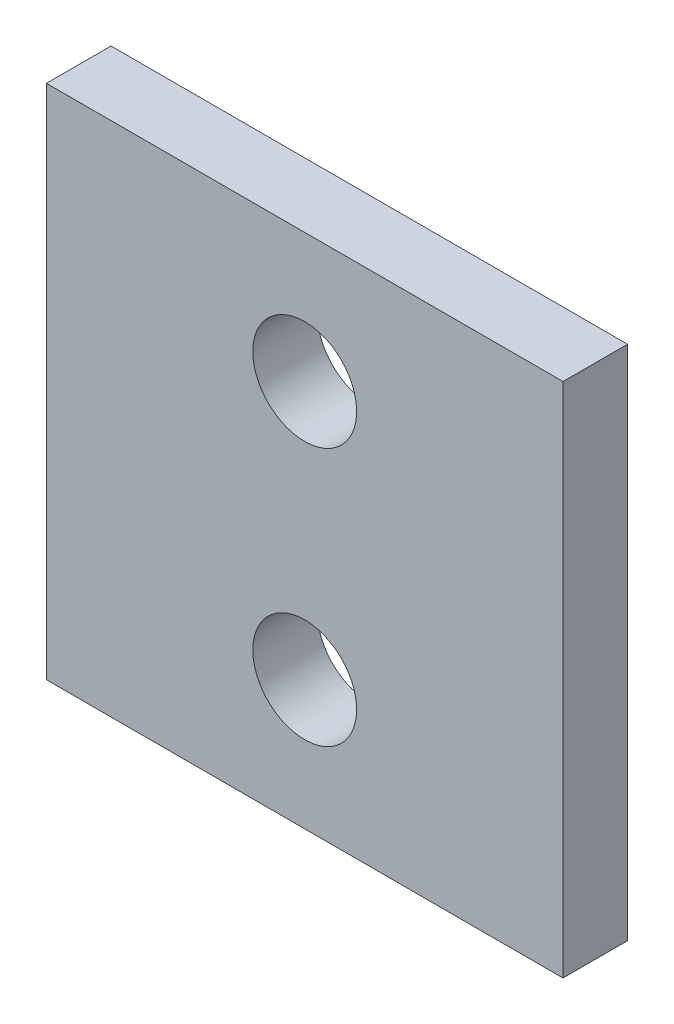
ISO-10303-21;
HEADER;
FILE_DESCRIPTION(('STEP AP214'),'2;1');
FILE_NAME('part.step','',(''),(''),'','','');
FILE_SCHEMA(('AUTOMOTIVE_DESIGN { 1 0 10303 214 1 1 1 1 }'));
ENDSEC;
DATA;
#1=APPLICATION_CONTEXT('core data for automotive mechanical design processes');
#2=APPLICATION_PROTOCOL_DEFINITION('international standard','automotive_design',2000,#1);
#3=PRODUCT_CONTEXT('',#1,'mechanical');
#4=PRODUCT('Part','Part','',(#3));
#5=PRODUCT_RELATED_PRODUCT_CATEGORY('part','',(#4));
#6=PRODUCT_DEFINITION_FORMATION('','',#4);
#7=PRODUCT_DEFINITION_CONTEXT('part definition',#1,'design');
#8=PRODUCT_DEFINITION('design','',#6,#7);
#9=PRODUCT_DEFINITION_SHAPE('','',#8);
#10=(LENGTH_UNIT() NAMED_UNIT(*) SI_UNIT(.MILLI.,.METRE.));
#11=(NAMED_UNIT(*) PLANE_ANGLE_UNIT() SI_UNIT($,.RADIAN.));
#12=(NAMED_UNIT(*) SI_UNIT($,.STERADIAN.) SOLID_ANGLE_UNIT());
#13=UNCERTAINTY_MEASURE_WITH_UNIT(LENGTH_MEASURE(1.E-05),#10,'distance_accuracy_value','');
#14=(GEOMETRIC_REPRESENTATION_CONTEXT(3) GLOBAL_UNCERTAINTY_ASSIGNED_CONTEXT((#13)) GLOBAL_UNIT_ASSIGNED_CONTEXT((#10,
#11,#12)) REPRESENTATION_CONTEXT('',''));
#15=CARTESIAN_POINT('',(0.,0.,0.));
#16=DIRECTION('',(0.,0.,1.));
#17=DIRECTION('',(1.,0.,0.));
#18=AXIS2_PLACEMENT_3D('',#15,#16,#17);
#19=CARTESIAN_POINT('',(0.,0.,3.175));
#20=DIRECTION('',(1.,0.,0.));
#21=DIRECTION('',(0.,0.,-1.));
#22=AXIS2_PLACEMENT_3D('',#19,#20,#21);
#23=PLANE('',#22);
#24=DIRECTION('',(0.,-1.,0.));
#25=VECTOR('',#24,1.);
#26=CARTESIAN_POINT('',(0.,0.,0.));
#27=LINE('',#26,#25);
#28=CARTESIAN_POINT('',(0.,25.4,0.));
#29=VERTEX_POINT('',#28);
#30=CARTESIAN_POINT('',(0.,0.,0.));
#31=VERTEX_POINT('',#30);
#32=EDGE_CURVE('E101',#29,#31,#27,.T.);
#33=ORIENTED_EDGE('',*,*,#32,.T.);
#34=DIRECTION('',(0.,0.,-1.));
#35=VECTOR('',#34,1.);
#36=CARTESIAN_POINT('',(0.,0.,3.175));
#37=LINE('',#36,#35);
#38=CARTESIAN_POINT('',(0.,0.,3.175));
#39=VERTEX_POINT('',#38);
#40=EDGE_CURVE('E11',#39,#31,#37,.T.);
#41=ORIENTED_EDGE('',*,*,#40,.F.);
#42=DIRECTION('',(0.,-1.,0.));
#43=VECTOR('',#42,1.);
#44=CARTESIAN_POINT('',(0.,0.,3.175));
#45=LINE('',#44,#43);
#46=CARTESIAN_POINT('',(0.,25.4,3.175));
#47=VERTEX_POINT('',#46);
#48=EDGE_CURVE('E89',#47,#39,#45,.T.);
#49=ORIENTED_EDGE('',*,*,#48,.F.);
#50=DIRECTION('',(0.,0.,-1.));
#51=VECTOR('',#50,1.);
#52=CARTESIAN_POINT('',(0.,25.4,3.175));
#53=LINE('',#52,#51);
#54=EDGE_CURVE('E97',#47,#29,#53,.T.);
#55=ORIENTED_EDGE('',*,*,#54,.T.);
#56=EDGE_LOOP('',(#33,#41,#49,#55));
#57=FACE_BOUND('',#56,.T.);
#58=ADVANCED_FACE('F38',(#57),#23,.F.);
#59=CARTESIAN_POINT('',(0.,0.,3.175));
#60=DIRECTION('',(0.,1.,0.));
#61=DIRECTION('',(0.,0.,1.));
#62=AXIS2_PLACEMENT_3D('',#59,#60,#61);
#63=PLANE('',#62);
#64=DIRECTION('',(1.,0.,0.));
#65=VECTOR('',#64,1.);
#66=CARTESIAN_POINT('',(0.,0.,0.));
#67=LINE('',#66,#65);
#68=CARTESIAN_POINT('',(25.4,0.,0.));
#69=VERTEX_POINT('',#68);
#70=EDGE_CURVE('E93',#31,#69,#67,.T.);
#71=ORIENTED_EDGE('',*,*,#70,.T.);
#72=DIRECTION('',(0.,0.,-1.));
#73=VECTOR('',#72,1.);
#74=CARTESIAN_POINT('',(25.4,0.,3.175));
#75=LINE('',#74,#73);
#76=CARTESIAN_POINT('',(25.4,0.,3.175));
#77=VERTEX_POINT('',#76);
#78=EDGE_CURVE('E46',#77,#69,#75,.T.);
#79=ORIENTED_EDGE('',*,*,#78,.F.);
#80=DIRECTION('',(1.,0.,0.));
#81=VECTOR('',#80,1.);
#82=CARTESIAN_POINT('',(0.,0.,3.175));
#83=LINE('',#82,#81);
#84=EDGE_CURVE('E84',#39,#77,#83,.T.);
#85=ORIENTED_EDGE('',*,*,#84,.F.);
#86=ORIENTED_EDGE('',*,*,#40,.T.);
#87=EDGE_LOOP('',(#71,#79,#85,#86));
#88=FACE_BOUND('',#87,.T.);
#89=ADVANCED_FACE('F92',(#88),#63,.F.);
#90=CARTESIAN_POINT('',(25.4,0.,3.175));
#91=DIRECTION('',(-1.,0.,0.));
#92=DIRECTION('',(0.,0.,1.));
#93=AXIS2_PLACEMENT_3D('',#90,#91,#92);
#94=PLANE('',#93);
#95=DIRECTION('',(0.,1.,0.));
#96=VECTOR('',#95,1.);
#97=CARTESIAN_POINT('',(25.4,0.,0.));
#98=LINE('',#97,#96);
#99=CARTESIAN_POINT('',(25.4,25.4,0.));
#100=VERTEX_POINT('',#99);
#101=EDGE_CURVE('E71',#69,#100,#98,.T.);
#102=ORIENTED_EDGE('',*,*,#101,.T.);
#103=DIRECTION('',(0.,0.,-1.));
#104=VECTOR('',#103,1.);
#105=CARTESIAN_POINT('',(25.4,25.4,3.175));
#106=LINE('',#105,#104);
#107=CARTESIAN_POINT('',(25.4,25.4,3.175));
#108=VERTEX_POINT('',#107);
#109=EDGE_CURVE('E94',#108,#100,#106,.T.);
#110=ORIENTED_EDGE('',*,*,#109,.F.);
#111=DIRECTION('',(0.,1.,0.));
#112=VECTOR('',#111,1.);
#113=CARTESIAN_POINT('',(25.4,0.,3.175));
#114=LINE('',#113,#112);
#115=EDGE_CURVE('E87',#77,#108,#114,.T.);
#116=ORIENTED_EDGE('',*,*,#115,.F.);
#117=ORIENTED_EDGE('',*,*,#78,.T.);
#118=EDGE_LOOP('',(#102,#110,#116,#117));
#119=FACE_BOUND('',#118,.T.);
#120=ADVANCED_FACE('F95',(#119),#94,.F.);
#121=CARTESIAN_POINT('',(0.,25.4,3.175));
#122=DIRECTION('',(0.,-1.,0.));
#123=DIRECTION('',(0.,0.,-1.));
#124=AXIS2_PLACEMENT_3D('',#121,#122,#123);
#125=PLANE('',#124);
#126=DIRECTION('',(-1.,0.,0.));
#127=VECTOR('',#126,1.);
#128=CARTESIAN_POINT('',(0.,25.4,0.));
#129=LINE('',#128,#127);
#130=EDGE_CURVE('E77',#100,#29,#129,.T.);
#131=ORIENTED_EDGE('',*,*,#130,.T.);
#132=ORIENTED_EDGE('',*,*,#54,.F.);
#133=DIRECTION('',(-1.,0.,0.));
#134=VECTOR('',#133,1.);
#135=CARTESIAN_POINT('',(0.,25.4,3.175));
#136=LINE('',#135,#134);
#137=EDGE_CURVE('E54',#108,#47,#136,.T.);
#138=ORIENTED_EDGE('',*,*,#137,.F.);
#139=ORIENTED_EDGE('',*,*,#109,.T.);
#140=EDGE_LOOP('',(#131,#132,#138,#139));
#141=FACE_BOUND('',#140,.T.);
#142=ADVANCED_FACE('F109',(#141),#125,.F.);
#143=CARTESIAN_POINT('',(0.,0.,3.175));
#144=DIRECTION('',(0.,0.,-1.));
#145=DIRECTION('',(-1.,0.,0.));
#146=AXIS2_PLACEMENT_3D('',#143,#144,#145);
#147=PLANE('',#146);
#148=CARTESIAN_POINT('',(12.7,6.35,3.175));
#149=DIRECTION('',(0.,0.,-1.));
#150=DIRECTION('',(-1.,0.,0.));
#151=AXIS2_PLACEMENT_3D('',#148,#149,#150);
#152=CIRCLE('',#151,2.5527);
#153=CARTESIAN_POINT('',(10.1473,6.35,3.175));
#154=VERTEX_POINT('',#153);
#155=EDGE_CURVE('E104',#154,#154,#152,.F.);
#156=ORIENTED_EDGE('',*,*,#155,.F.);
#157=EDGE_LOOP('',(#156));
#158=FACE_BOUND('',#157,.T.);
#159=CARTESIAN_POINT('',(12.7,19.05,3.175));
#160=DIRECTION('',(0.,0.,-1.));
#161=DIRECTION('',(-1.,0.,0.));
#162=AXIS2_PLACEMENT_3D('',#159,#160,#161);
#163=CIRCLE('',#162,2.5527);
#164=CARTESIAN_POINT('',(10.1473,19.05,3.175));
#165=VERTEX_POINT('',#164);
#166=EDGE_CURVE('E115',#165,#165,#163,.F.);
#167=ORIENTED_EDGE('',*,*,#166,.F.);
#168=EDGE_LOOP('',(#167));
#169=FACE_BOUND('',#168,.T.);
#170=ORIENTED_EDGE('',*,*,#48,.T.);
#171=ORIENTED_EDGE('',*,*,#84,.T.);
#172=ORIENTED_EDGE('',*,*,#115,.T.);
#173=ORIENTED_EDGE('',*,*,#137,.T.);
#174=EDGE_LOOP('',(#170,#171,#172,#173));
#175=FACE_BOUND('',#174,.T.);
#176=ADVANCED_FACE('F85',(#158,#169,#175),#147,.F.);
#177=CARTESIAN_POINT('',(0.,0.,0.));
#178=DIRECTION('',(0.,0.,-1.));
#179=DIRECTION('',(-1.,0.,0.));
#180=AXIS2_PLACEMENT_3D('',#177,#178,#179);
#181=PLANE('',#180);
#182=CARTESIAN_POINT('',(12.7,6.35,0.));
#183=DIRECTION('',(0.,0.,-1.));
#184=DIRECTION('',(-1.,0.,0.));
#185=AXIS2_PLACEMENT_3D('',#182,#183,#184);
#186=CIRCLE('',#185,2.5527);
#187=CARTESIAN_POINT('',(10.1473,6.35,0.));
#188=VERTEX_POINT('',#187);
#189=EDGE_CURVE('E118',#188,#188,#186,.T.);
#190=ORIENTED_EDGE('',*,*,#189,.F.);
#191=EDGE_LOOP('',(#190));
#192=FACE_BOUND('',#191,.T.);
#193=CARTESIAN_POINT('',(12.7,19.05,0.));
#194=DIRECTION('',(0.,0.,-1.));
#195=DIRECTION('',(-1.,0.,0.));
#196=AXIS2_PLACEMENT_3D('',#193,#194,#195);
#197=CIRCLE('',#196,2.5527);
#198=CARTESIAN_POINT('',(10.1473,19.05,0.));
#199=VERTEX_POINT('',#198);
#200=EDGE_CURVE('E119',#199,#199,#197,.T.);
#201=ORIENTED_EDGE('',*,*,#200,.F.);
#202=EDGE_LOOP('',(#201));
#203=FACE_BOUND('',#202,.T.);
#204=ORIENTED_EDGE('',*,*,#32,.F.);
#205=ORIENTED_EDGE('',*,*,#130,.F.);
#206=ORIENTED_EDGE('',*,*,#101,.F.);
#207=ORIENTED_EDGE('',*,*,#70,.F.);
#208=EDGE_LOOP('',(#204,#205,#206,#207));
#209=FACE_BOUND('',#208,.T.);
#210=ADVANCED_FACE('F112',(#192,#203,#209),#181,.T.);
#211=CARTESIAN_POINT('',(12.7,19.05,3.176));
#212=DIRECTION('',(0.,0.,-1.));
#213=DIRECTION('',(-1.,0.,0.));
#214=AXIS2_PLACEMENT_3D('',#211,#212,#213);
#215=CYLINDRICAL_SURFACE('',#214,2.5527);
#216=ORIENTED_EDGE('',*,*,#200,.T.);
#217=EDGE_LOOP('',(#216));
#218=FACE_BOUND('',#217,.T.);
#219=ORIENTED_EDGE('',*,*,#166,.T.);
#220=EDGE_LOOP('',(#219));
#221=FACE_BOUND('',#220,.T.);
#222=ADVANCED_FACE('F132',(#218,#221),#215,.F.);
#223=CARTESIAN_POINT('',(12.7,6.35,3.176));
#224=DIRECTION('',(0.,0.,-1.));
#225=DIRECTION('',(-1.,0.,0.));
#226=AXIS2_PLACEMENT_3D('',#223,#224,#225);
#227=CYLINDRICAL_SURFACE('',#226,2.5527);
#228=ORIENTED_EDGE('',*,*,#189,.T.);
#229=EDGE_LOOP('',(#228));
#230=FACE_BOUND('',#229,.T.);
#231=ORIENTED_EDGE('',*,*,#155,.T.);
#232=EDGE_LOOP('',(#231));
#233=FACE_BOUND('',#232,.T.);
#234=ADVANCED_FACE('F127',(#230,#233),#227,.F.);
#235=CLOSED_SHELL('',(#58,#89,#120,#142,#176,#210,#222,#234));
#236=MANIFOLD_SOLID_BREP('B2',#235);
#237=ADVANCED_BREP_SHAPE_REPRESENTATION('',(#18,#236),#14);
#238=SHAPE_DEFINITION_REPRESENTATION(#9,#237);
ENDSEC;
END-ISO-10303-21;
